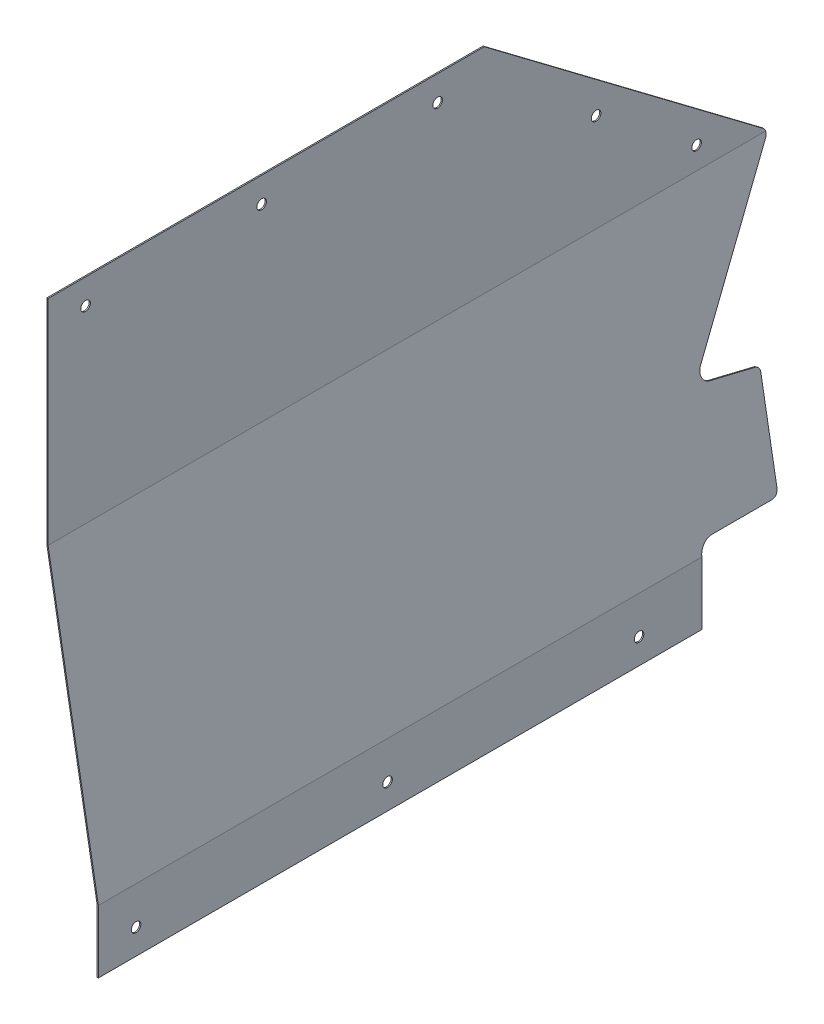
ISO-10303-21;
HEADER;
FILE_DESCRIPTION(('STEP AP214'),'2;1');
FILE_NAME('part.step','',(''),(''),'','','');
FILE_SCHEMA(('AUTOMOTIVE_DESIGN { 1 0 10303 214 1 1 1 1 }'));
ENDSEC;
DATA;
#1=APPLICATION_CONTEXT('core data for automotive mechanical design processes');
#2=APPLICATION_PROTOCOL_DEFINITION('international standard','automotive_design',2000,#1);
#3=PRODUCT_CONTEXT('',#1,'mechanical');
#4=PRODUCT('Part','Part','',(#3));
#5=PRODUCT_RELATED_PRODUCT_CATEGORY('part','',(#4));
#6=PRODUCT_DEFINITION_FORMATION('','',#4);
#7=PRODUCT_DEFINITION_CONTEXT('part definition',#1,'design');
#8=PRODUCT_DEFINITION('design','',#6,#7);
#9=PRODUCT_DEFINITION_SHAPE('','',#8);
#10=(LENGTH_UNIT() NAMED_UNIT(*) SI_UNIT(.MILLI.,.METRE.));
#11=(NAMED_UNIT(*) PLANE_ANGLE_UNIT() SI_UNIT($,.RADIAN.));
#12=(NAMED_UNIT(*) SI_UNIT($,.STERADIAN.) SOLID_ANGLE_UNIT());
#13=UNCERTAINTY_MEASURE_WITH_UNIT(LENGTH_MEASURE(1.E-05),#10,'distance_accuracy_value','');
#14=(GEOMETRIC_REPRESENTATION_CONTEXT(3) GLOBAL_UNCERTAINTY_ASSIGNED_CONTEXT((#13)) GLOBAL_UNIT_ASSIGNED_CONTEXT((#10,
#11,#12)) REPRESENTATION_CONTEXT('',''));
#15=CARTESIAN_POINT('',(0.,0.,0.));
#16=DIRECTION('',(0.,0.,1.));
#17=DIRECTION('',(1.,0.,0.));
#18=AXIS2_PLACEMENT_3D('',#15,#16,#17);
#19=CARTESIAN_POINT('',(266.7,5923.28000062489,-3055.84367308646));
#20=DIRECTION('',(0.,-0.798635510047341,0.601815023151985));
#21=DIRECTION('',(0.,0.601815023151985,0.798635510047341));
#22=AXIS2_PLACEMENT_3D('',#19,#20,#21);
#23=PLANE('',#22);
#24=DIRECTION('',(0.,0.601815023151988,0.798635510047338));
#25=VECTOR('',#24,1.);
#26=CARTESIAN_POINT('',(266.700000000003,5874.23441641765,-3120.92936163202));
#27=LINE('',#26,#25);
#28=CARTESIAN_POINT('',(266.700000000003,5874.23441641766,-3120.92936163202));
#29=VERTEX_POINT('',#28);
#30=CARTESIAN_POINT('',(266.699999999999,5980.43000062489,-2980.00306153083));
#31=VERTEX_POINT('',#30);
#32=EDGE_CURVE('E230',#29,#31,#27,.T.);
#33=ORIENTED_EDGE('',*,*,#32,.F.);
#34=DIRECTION('',(-0.995708210528336,-0.0556968651427743,-0.0739122364681644));
#35=VECTOR('',#34,1.);
#36=CARTESIAN_POINT('',(273.348331735291,5874.60630371574,-3120.43585051889));
#37=LINE('',#36,#35);
#38=CARTESIAN_POINT('',(266.090400000003,5874.20031726227,-3120.9746127396));
#39=VERTEX_POINT('',#38);
#40=EDGE_CURVE('E158',#29,#39,#37,.T.);
#41=ORIENTED_EDGE('',*,*,#40,.T.);
#42=DIRECTION('',(0.,0.601815023151969,0.798635510047353));
#43=VECTOR('',#42,1.);
#44=CARTESIAN_POINT('',(266.090400000003,5874.20031726228,-3120.97461273959));
#45=LINE('',#44,#43);
#46=CARTESIAN_POINT('',(266.090399999999,5980.43000062489,-2980.00306153083));
#47=VERTEX_POINT('',#46);
#48=EDGE_CURVE('E227',#39,#47,#45,.T.);
#49=ORIENTED_EDGE('',*,*,#48,.T.);
#50=DIRECTION('',(1.,0.,0.));
#51=VECTOR('',#50,1.);
#52=CARTESIAN_POINT('',(266.7,5980.43000062489,-2980.00306153083));
#53=LINE('',#52,#51);
#54=EDGE_CURVE('E239',#31,#47,#53,.F.);
#55=ORIENTED_EDGE('',*,*,#54,.F.);
#56=EDGE_LOOP('',(#33,#41,#49,#55));
#57=FACE_BOUND('',#56,.T.);
#58=ADVANCED_FACE('F39',(#57),#23,.F.);
#59=CARTESIAN_POINT('',(266.7,5980.43000062489,-2874.06989807406));
#60=DIRECTION('',(0.,-1.,0.));
#61=DIRECTION('',(1.,0.,0.));
#62=AXIS2_PLACEMENT_3D('',#59,#60,#61);
#63=PLANE('',#62);
#64=DIRECTION('',(1.,0.,0.));
#65=VECTOR('',#64,1.);
#66=CARTESIAN_POINT('',(266.7,5980.43000062489,-2759.71));
#67=LINE('',#66,#65);
#68=CARTESIAN_POINT('',(266.0904,5980.43000062489,-2759.71));
#69=VERTEX_POINT('',#68);
#70=CARTESIAN_POINT('',(266.7,5980.43000062489,-2759.71));
#71=VERTEX_POINT('',#70);
#72=EDGE_CURVE('E234',#69,#71,#67,.T.);
#73=ORIENTED_EDGE('',*,*,#72,.T.);
#74=DIRECTION('',(0.,0.,-1.));
#75=VECTOR('',#74,1.);
#76=CARTESIAN_POINT('',(266.7,5980.43000062489,-2759.71));
#77=LINE('',#76,#75);
#78=EDGE_CURVE('E233',#31,#71,#77,.F.);
#79=ORIENTED_EDGE('',*,*,#78,.F.);
#80=ORIENTED_EDGE('',*,*,#54,.T.);
#81=DIRECTION('',(0.,0.,-1.));
#82=VECTOR('',#81,1.);
#83=CARTESIAN_POINT('',(266.0904,5980.43000062489,-2759.71));
#84=LINE('',#83,#82);
#85=EDGE_CURVE('E223',#47,#69,#84,.F.);
#86=ORIENTED_EDGE('',*,*,#85,.T.);
#87=EDGE_LOOP('',(#73,#79,#80,#86));
#88=FACE_BOUND('',#87,.T.);
#89=ADVANCED_FACE('F292',(#88),#63,.F.);
#90=CARTESIAN_POINT('',(266.090400000003,5883.74292329504,-3087.20831702677));
#91=DIRECTION('',(1.,0.,0.));
#92=DIRECTION('',(0.,1.,0.));
#93=AXIS2_PLACEMENT_3D('',#90,#91,#92);
#94=CYLINDRICAL_SURFACE('',#93,2.41300000000024);
#95=CARTESIAN_POINT('',(266.090400000003,5883.74292329504,-3087.20831702677));
#96=DIRECTION('',(-1.,0.,0.));
#97=DIRECTION('',(0.,1.,0.));
#98=AXIS2_PLACEMENT_3D('',#95,#96,#97);
#99=CIRCLE('',#98,2.41300000000024);
#100=CARTESIAN_POINT('',(266.090400000003,5886.15592329504,-3087.20831702677));
#101=VERTEX_POINT('',#100);
#102=EDGE_CURVE('E226',#101,#101,#99,.T.);
#103=ORIENTED_EDGE('',*,*,#102,.T.);
#104=EDGE_LOOP('',(#103));
#105=FACE_BOUND('',#104,.T.);
#106=CARTESIAN_POINT('',(266.700000000003,5883.74292329504,-3087.20831702677));
#107=DIRECTION('',(-1.,0.,0.));
#108=DIRECTION('',(0.,1.,0.));
#109=AXIS2_PLACEMENT_3D('',#106,#107,#108);
#110=CIRCLE('',#109,2.41300000000024);
#111=CARTESIAN_POINT('',(266.700000000002,5886.15592329504,-3087.20831702677));
#112=VERTEX_POINT('',#111);
#113=EDGE_CURVE('E42',#112,#112,#110,.T.);
#114=ORIENTED_EDGE('',*,*,#113,.F.);
#115=EDGE_LOOP('',(#114));
#116=FACE_BOUND('',#115,.T.);
#117=ADVANCED_FACE('F297',(#105,#116),#94,.F.);
#118=CARTESIAN_POINT('',(266.090400000003,5921.95817726519,-3036.49496213877));
#119=DIRECTION('',(1.,0.,0.));
#120=DIRECTION('',(0.,1.,0.));
#121=AXIS2_PLACEMENT_3D('',#118,#119,#120);
#122=CYLINDRICAL_SURFACE('',#121,2.41300000000024);
#123=CARTESIAN_POINT('',(266.0904,5921.95817726519,-3036.49496213877));
#124=DIRECTION('',(-1.,0.,0.));
#125=DIRECTION('',(0.,1.,0.));
#126=AXIS2_PLACEMENT_3D('',#123,#124,#125);
#127=CIRCLE('',#126,2.41300000000024);
#128=CARTESIAN_POINT('',(266.0904,5924.37117726519,-3036.49496213877));
#129=VERTEX_POINT('',#128);
#130=EDGE_CURVE('E479',#129,#129,#127,.T.);
#131=ORIENTED_EDGE('',*,*,#130,.T.);
#132=EDGE_LOOP('',(#131));
#133=FACE_BOUND('',#132,.T.);
#134=CARTESIAN_POINT('',(266.700000000003,5921.95817726519,-3036.49496213877));
#135=DIRECTION('',(-1.,0.,0.));
#136=DIRECTION('',(0.,1.,0.));
#137=AXIS2_PLACEMENT_3D('',#134,#135,#136);
#138=CIRCLE('',#137,2.41300000000024);
#139=CARTESIAN_POINT('',(266.700000000002,5924.37117726519,-3036.49496213877));
#140=VERTEX_POINT('',#139);
#141=EDGE_CURVE('E385',#140,#140,#138,.T.);
#142=ORIENTED_EDGE('',*,*,#141,.F.);
#143=EDGE_LOOP('',(#142));
#144=FACE_BOUND('',#143,.T.);
#145=ADVANCED_FACE('F394',(#133,#144),#122,.F.);
#146=CARTESIAN_POINT('',(266.0904,5967.73000051653,-2956.44607591665));
#147=DIRECTION('',(1.,0.,0.));
#148=DIRECTION('',(0.,1.,0.));
#149=AXIS2_PLACEMENT_3D('',#146,#147,#148);
#150=CYLINDRICAL_SURFACE('',#149,2.41300000000024);
#151=CARTESIAN_POINT('',(266.0904,5967.73000051653,-2956.44607591665));
#152=DIRECTION('',(-1.,0.,0.));
#153=DIRECTION('',(0.,1.,0.));
#154=AXIS2_PLACEMENT_3D('',#151,#152,#153);
#155=CIRCLE('',#154,2.41300000000024);
#156=CARTESIAN_POINT('',(266.0904,5970.14300051653,-2956.44607591665));
#157=VERTEX_POINT('',#156);
#158=EDGE_CURVE('E477',#157,#157,#155,.T.);
#159=ORIENTED_EDGE('',*,*,#158,.T.);
#160=EDGE_LOOP('',(#159));
#161=FACE_BOUND('',#160,.T.);
#162=CARTESIAN_POINT('',(266.7,5967.73000051653,-2956.44607591665));
#163=DIRECTION('',(-1.,0.,0.));
#164=DIRECTION('',(0.,1.,0.));
#165=AXIS2_PLACEMENT_3D('',#162,#163,#164);
#166=CIRCLE('',#165,2.41300000000024);
#167=CARTESIAN_POINT('',(266.7,5970.14300051653,-2956.44607591665));
#168=VERTEX_POINT('',#167);
#169=EDGE_CURVE('E216',#168,#168,#166,.T.);
#170=ORIENTED_EDGE('',*,*,#169,.F.);
#171=EDGE_LOOP('',(#170));
#172=FACE_BOUND('',#171,.T.);
#173=ADVANCED_FACE('F400',(#161,#172),#150,.F.);
#174=CARTESIAN_POINT('',(266.0904,5967.73000018003,-2778.64607591665));
#175=DIRECTION('',(1.,0.,0.));
#176=DIRECTION('',(0.,1.,0.));
#177=AXIS2_PLACEMENT_3D('',#174,#175,#176);
#178=CYLINDRICAL_SURFACE('',#177,2.41300000000024);
#179=CARTESIAN_POINT('',(266.0904,5967.73000018003,-2778.64607591665));
#180=DIRECTION('',(-1.,0.,0.));
#181=DIRECTION('',(0.,1.,0.));
#182=AXIS2_PLACEMENT_3D('',#179,#180,#181);
#183=CIRCLE('',#182,2.41300000000024);
#184=CARTESIAN_POINT('',(266.0904,5970.14300018004,-2778.64607591665));
#185=VERTEX_POINT('',#184);
#186=EDGE_CURVE('E474',#185,#185,#183,.T.);
#187=ORIENTED_EDGE('',*,*,#186,.T.);
#188=EDGE_LOOP('',(#187));
#189=FACE_BOUND('',#188,.T.);
#190=CARTESIAN_POINT('',(266.7,5967.73000018003,-2778.64607591665));
#191=DIRECTION('',(-1.,0.,0.));
#192=DIRECTION('',(0.,1.,0.));
#193=AXIS2_PLACEMENT_3D('',#190,#191,#192);
#194=CIRCLE('',#193,2.41300000000024);
#195=CARTESIAN_POINT('',(266.7,5970.14300018004,-2778.64607591665));
#196=VERTEX_POINT('',#195);
#197=EDGE_CURVE('E380',#196,#196,#194,.T.);
#198=ORIENTED_EDGE('',*,*,#197,.F.);
#199=EDGE_LOOP('',(#198));
#200=FACE_BOUND('',#199,.T.);
#201=ADVANCED_FACE('F407',(#189,#200),#178,.F.);
#202=CARTESIAN_POINT('',(266.0904,5967.73000034828,-2867.54607591665));
#203=DIRECTION('',(1.,0.,0.));
#204=DIRECTION('',(0.,1.,0.));
#205=AXIS2_PLACEMENT_3D('',#202,#203,#204);
#206=CYLINDRICAL_SURFACE('',#205,2.41300000000024);
#207=CARTESIAN_POINT('',(266.0904,5967.73000034828,-2867.54607591665));
#208=DIRECTION('',(-1.,0.,0.));
#209=DIRECTION('',(0.,1.,0.));
#210=AXIS2_PLACEMENT_3D('',#207,#208,#209);
#211=CIRCLE('',#210,2.41300000000024);
#212=CARTESIAN_POINT('',(266.0904,5970.14300034829,-2867.54607591665));
#213=VERTEX_POINT('',#212);
#214=EDGE_CURVE('E250',#213,#213,#211,.T.);
#215=ORIENTED_EDGE('',*,*,#214,.T.);
#216=EDGE_LOOP('',(#215));
#217=FACE_BOUND('',#216,.T.);
#218=CARTESIAN_POINT('',(266.7,5967.73000034828,-2867.54607591665));
#219=DIRECTION('',(-1.,0.,0.));
#220=DIRECTION('',(0.,1.,0.));
#221=AXIS2_PLACEMENT_3D('',#218,#219,#220);
#222=CIRCLE('',#221,2.41300000000024);
#223=CARTESIAN_POINT('',(266.7,5970.14300034829,-2867.54607591665));
#224=VERTEX_POINT('',#223);
#225=EDGE_CURVE('E383',#224,#224,#222,.T.);
#226=ORIENTED_EDGE('',*,*,#225,.F.);
#227=EDGE_LOOP('',(#226));
#228=FACE_BOUND('',#227,.T.);
#229=ADVANCED_FACE('F411',(#217,#228),#206,.F.);
#230=CARTESIAN_POINT('',(266.7,5974.08000062489,-2759.71));
#231=DIRECTION('',(-1.,0.,0.));
#232=DIRECTION('',(0.,-1.,0.));
#233=AXIS2_PLACEMENT_3D('',#230,#231,#232);
#234=PLANE('',#233);
#235=ORIENTED_EDGE('',*,*,#169,.T.);
#236=EDGE_LOOP('',(#235));
#237=FACE_BOUND('',#236,.T.);
#238=ORIENTED_EDGE('',*,*,#197,.T.);
#239=EDGE_LOOP('',(#238));
#240=FACE_BOUND('',#239,.T.);
#241=ORIENTED_EDGE('',*,*,#225,.T.);
#242=EDGE_LOOP('',(#241));
#243=FACE_BOUND('',#242,.T.);
#244=ORIENTED_EDGE('',*,*,#141,.T.);
#245=EDGE_LOOP('',(#244));
#246=FACE_BOUND('',#245,.T.);
#247=ORIENTED_EDGE('',*,*,#113,.T.);
#248=EDGE_LOOP('',(#247));
#249=FACE_BOUND('',#248,.T.);
#250=DIRECTION('',(0.,0.,-1.));
#251=VECTOR('',#250,1.);
#252=CARTESIAN_POINT('',(266.7,5872.48000062489,-2759.71));
#253=LINE('',#252,#251);
#254=CARTESIAN_POINT('',(266.700000000001,5872.48000062488,-3122.10149619294));
#255=VERTEX_POINT('',#254);
#256=CARTESIAN_POINT('',(266.7,5872.48000062489,-2759.71));
#257=VERTEX_POINT('',#256);
#258=EDGE_CURVE('E162',#255,#257,#253,.F.);
#259=ORIENTED_EDGE('',*,*,#258,.F.);
#260=CARTESIAN_POINT('',(266.700000000003,5871.69874867326,-3119.01859893352));
#261=DIRECTION('',(1.,0.,0.));
#262=DIRECTION('',(0.,-0.601815023151986,-0.79863551004734));
#263=AXIS2_PLACEMENT_3D('',#260,#261,#262);
#264=ELLIPSE('',#263,3.1886851654214,3.175);
#265=EDGE_CURVE('E141',#255,#29,#264,.T.);
#266=ORIENTED_EDGE('',*,*,#265,.T.);
#267=ORIENTED_EDGE('',*,*,#32,.T.);
#268=ORIENTED_EDGE('',*,*,#78,.T.);
#269=DIRECTION('',(0.,1.,0.));
#270=VECTOR('',#269,1.);
#271=CARTESIAN_POINT('',(266.7,5715.,-2759.71));
#272=LINE('',#271,#270);
#273=EDGE_CURVE('E249',#257,#71,#272,.T.);
#274=ORIENTED_EDGE('',*,*,#273,.F.);
#275=EDGE_LOOP('',(#259,#266,#267,#268,#274));
#276=FACE_BOUND('',#275,.T.);
#277=ADVANCED_FACE('F304',(#237,#240,#243,#246,#249,#276),#234,.F.);
#278=CARTESIAN_POINT('',(292.1,5727.7,-2759.71));
#279=DIRECTION('',(-1.,0.,0.));
#280=DIRECTION('',(0.,0.,-1.));
#281=AXIS2_PLACEMENT_3D('',#278,#279,#280);
#282=PLANE('',#281);
#283=CARTESIAN_POINT('',(292.1,5708.65,-2778.76));
#284=DIRECTION('',(-1.,0.,0.));
#285=DIRECTION('',(0.,0.,1.));
#286=AXIS2_PLACEMENT_3D('',#283,#284,#285);
#287=CIRCLE('',#286,2.4129999999991);
#288=CARTESIAN_POINT('',(292.1,5708.65,-2776.347));
#289=VERTEX_POINT('',#288);
#290=EDGE_CURVE('E166',#289,#289,#287,.F.);
#291=ORIENTED_EDGE('',*,*,#290,.F.);
#292=EDGE_LOOP('',(#291));
#293=FACE_BOUND('',#292,.T.);
#294=CARTESIAN_POINT('',(292.1,5708.65,-2905.76));
#295=DIRECTION('',(-1.,0.,0.));
#296=DIRECTION('',(0.,0.,1.));
#297=AXIS2_PLACEMENT_3D('',#294,#295,#296);
#298=CIRCLE('',#297,2.4129999999991);
#299=CARTESIAN_POINT('',(292.1,5708.65,-2903.347));
#300=VERTEX_POINT('',#299);
#301=EDGE_CURVE('E373',#300,#300,#298,.F.);
#302=ORIENTED_EDGE('',*,*,#301,.F.);
#303=EDGE_LOOP('',(#302));
#304=FACE_BOUND('',#303,.T.);
#305=CARTESIAN_POINT('',(292.1,5708.65,-3032.76));
#306=DIRECTION('',(-1.,0.,0.));
#307=DIRECTION('',(0.,0.,1.));
#308=AXIS2_PLACEMENT_3D('',#305,#306,#307);
#309=CIRCLE('',#308,2.4129999999991);
#310=CARTESIAN_POINT('',(292.1,5708.65,-3030.347));
#311=VERTEX_POINT('',#310);
#312=EDGE_CURVE('E194',#311,#311,#309,.F.);
#313=ORIENTED_EDGE('',*,*,#312,.F.);
#314=EDGE_LOOP('',(#313));
#315=FACE_BOUND('',#314,.T.);
#316=DIRECTION('',(0.,0.,-1.));
#317=VECTOR('',#316,1.);
#318=CARTESIAN_POINT('',(292.1,5695.95,-2912.11));
#319=LINE('',#318,#317);
#320=CARTESIAN_POINT('',(292.1,5695.95,-3064.51));
#321=VERTEX_POINT('',#320);
#322=CARTESIAN_POINT('',(292.1,5695.95,-2759.71));
#323=VERTEX_POINT('',#322);
#324=EDGE_CURVE('E213',#321,#323,#319,.F.);
#325=ORIENTED_EDGE('',*,*,#324,.F.);
#326=DIRECTION('',(0.,1.,0.));
#327=VECTOR('',#326,1.);
#328=CARTESIAN_POINT('',(292.1,5715.,-3064.51));
#329=LINE('',#328,#327);
#330=CARTESIAN_POINT('',(292.1,5727.7,-3064.51));
#331=VERTEX_POINT('',#330);
#332=EDGE_CURVE('E198',#331,#321,#329,.F.);
#333=ORIENTED_EDGE('',*,*,#332,.F.);
#334=DIRECTION('',(0.,0.,-1.));
#335=VECTOR('',#334,1.);
#336=CARTESIAN_POINT('',(292.100000000001,5727.7,-2759.71));
#337=LINE('',#336,#335);
#338=CARTESIAN_POINT('',(292.1,5727.7,-2759.71));
#339=VERTEX_POINT('',#338);
#340=EDGE_CURVE('E145',#339,#331,#337,.T.);
#341=ORIENTED_EDGE('',*,*,#340,.F.);
#342=DIRECTION('',(0.,1.,0.));
#343=VECTOR('',#342,1.);
#344=CARTESIAN_POINT('',(292.1,5715.,-2759.71));
#345=LINE('',#344,#343);
#346=EDGE_CURVE('E209',#323,#339,#345,.T.);
#347=ORIENTED_EDGE('',*,*,#346,.F.);
#348=EDGE_LOOP('',(#325,#333,#341,#347));
#349=FACE_BOUND('',#348,.T.);
#350=ADVANCED_FACE('F418',(#293,#304,#315,#349),#282,.F.);
#351=CARTESIAN_POINT('',(292.1,5695.95,-2912.11));
#352=DIRECTION('',(0.,1.,0.));
#353=DIRECTION('',(-1.,0.,0.));
#354=AXIS2_PLACEMENT_3D('',#351,#352,#353);
#355=PLANE('',#354);
#356=DIRECTION('',(-1.,0.,0.));
#357=VECTOR('',#356,1.);
#358=CARTESIAN_POINT('',(292.1,5695.95,-3064.51));
#359=LINE('',#358,#357);
#360=CARTESIAN_POINT('',(291.490399999999,5695.95,-3064.51));
#361=VERTEX_POINT('',#360);
#362=EDGE_CURVE('E195',#321,#361,#359,.T.);
#363=ORIENTED_EDGE('',*,*,#362,.F.);
#364=ORIENTED_EDGE('',*,*,#324,.T.);
#365=DIRECTION('',(1.,0.,0.));
#366=VECTOR('',#365,1.);
#367=CARTESIAN_POINT('',(292.1,5695.95,-2759.71));
#368=LINE('',#367,#366);
#369=CARTESIAN_POINT('',(291.4904,5695.95,-2759.71));
#370=VERTEX_POINT('',#369);
#371=EDGE_CURVE('E206',#370,#323,#368,.T.);
#372=ORIENTED_EDGE('',*,*,#371,.F.);
#373=DIRECTION('',(0.,0.,-1.));
#374=VECTOR('',#373,1.);
#375=CARTESIAN_POINT('',(291.4904,5695.95,-2759.71));
#376=LINE('',#375,#374);
#377=EDGE_CURVE('E188',#370,#361,#376,.T.);
#378=ORIENTED_EDGE('',*,*,#377,.T.);
#379=EDGE_LOOP('',(#363,#364,#372,#378));
#380=FACE_BOUND('',#379,.T.);
#381=ADVANCED_FACE('F422',(#380),#355,.F.);
#382=CARTESIAN_POINT('',(292.1,5715.,-3064.51));
#383=DIRECTION('',(0.,0.,1.));
#384=DIRECTION('',(-1.,0.,0.));
#385=AXIS2_PLACEMENT_3D('',#382,#383,#384);
#386=PLANE('',#385);
#387=DIRECTION('',(0.,1.,0.));
#388=VECTOR('',#387,1.);
#389=CARTESIAN_POINT('',(291.490399999999,5727.7,-3064.51));
#390=LINE('',#389,#388);
#391=CARTESIAN_POINT('',(291.490399999999,5727.59305263203,-3064.51));
#392=VERTEX_POINT('',#391);
#393=EDGE_CURVE('E184',#361,#392,#390,.T.);
#394=ORIENTED_EDGE('',*,*,#393,.T.);
#395=DIRECTION('',(0.984957024770471,0.172799477300427,0.));
#396=VECTOR('',#395,1.);
#397=CARTESIAN_POINT('',(291.4904,5727.59305263203,-3064.51));
#398=LINE('',#397,#396);
#399=EDGE_CURVE('E191',#392,#331,#398,.T.);
#400=ORIENTED_EDGE('',*,*,#399,.T.);
#401=ORIENTED_EDGE('',*,*,#332,.T.);
#402=ORIENTED_EDGE('',*,*,#362,.T.);
#403=EDGE_LOOP('',(#394,#400,#401,#402));
#404=FACE_BOUND('',#403,.T.);
#405=ADVANCED_FACE('F426',(#404),#386,.F.);
#406=CARTESIAN_POINT('',(291.4904,5708.65,-3032.76));
#407=DIRECTION('',(1.,0.,0.));
#408=DIRECTION('',(0.,0.,1.));
#409=AXIS2_PLACEMENT_3D('',#406,#407,#408);
#410=CYLINDRICAL_SURFACE('',#409,2.4129999999991);
#411=CARTESIAN_POINT('',(291.4904,5708.65,-3032.76));
#412=DIRECTION('',(-1.,0.,0.));
#413=DIRECTION('',(0.,0.,1.));
#414=AXIS2_PLACEMENT_3D('',#411,#412,#413);
#415=CIRCLE('',#414,2.4129999999991);
#416=CARTESIAN_POINT('',(291.4904,5708.65,-3030.347));
#417=VERTEX_POINT('',#416);
#418=EDGE_CURVE('E187',#417,#417,#415,.T.);
#419=ORIENTED_EDGE('',*,*,#418,.T.);
#420=EDGE_LOOP('',(#419));
#421=FACE_BOUND('',#420,.T.);
#422=ORIENTED_EDGE('',*,*,#312,.T.);
#423=EDGE_LOOP('',(#422));
#424=FACE_BOUND('',#423,.T.);
#425=ADVANCED_FACE('F430',(#421,#424),#410,.F.);
#426=CARTESIAN_POINT('',(291.4904,5708.65,-2905.76));
#427=DIRECTION('',(1.,0.,0.));
#428=DIRECTION('',(0.,0.,1.));
#429=AXIS2_PLACEMENT_3D('',#426,#427,#428);
#430=CYLINDRICAL_SURFACE('',#429,2.4129999999991);
#431=CARTESIAN_POINT('',(291.4904,5708.65,-2905.76));
#432=DIRECTION('',(-1.,0.,0.));
#433=DIRECTION('',(0.,0.,1.));
#434=AXIS2_PLACEMENT_3D('',#431,#432,#433);
#435=CIRCLE('',#434,2.4129999999991);
#436=CARTESIAN_POINT('',(291.4904,5708.65,-2903.347));
#437=VERTEX_POINT('',#436);
#438=EDGE_CURVE('E467',#437,#437,#435,.T.);
#439=ORIENTED_EDGE('',*,*,#438,.T.);
#440=EDGE_LOOP('',(#439));
#441=FACE_BOUND('',#440,.T.);
#442=ORIENTED_EDGE('',*,*,#301,.T.);
#443=EDGE_LOOP('',(#442));
#444=FACE_BOUND('',#443,.T.);
#445=ADVANCED_FACE('F434',(#441,#444),#430,.F.);
#446=CARTESIAN_POINT('',(291.4904,5708.65,-2778.76));
#447=DIRECTION('',(1.,0.,0.));
#448=DIRECTION('',(0.,0.,1.));
#449=AXIS2_PLACEMENT_3D('',#446,#447,#448);
#450=CYLINDRICAL_SURFACE('',#449,2.4129999999991);
#451=CARTESIAN_POINT('',(291.4904,5708.65,-2778.76));
#452=DIRECTION('',(-1.,0.,0.));
#453=DIRECTION('',(0.,0.,1.));
#454=AXIS2_PLACEMENT_3D('',#451,#452,#453);
#455=CIRCLE('',#454,2.4129999999991);
#456=CARTESIAN_POINT('',(291.4904,5708.65,-2776.347));
#457=VERTEX_POINT('',#456);
#458=EDGE_CURVE('E464',#457,#457,#455,.T.);
#459=ORIENTED_EDGE('',*,*,#458,.T.);
#460=EDGE_LOOP('',(#459));
#461=FACE_BOUND('',#460,.T.);
#462=ORIENTED_EDGE('',*,*,#290,.T.);
#463=EDGE_LOOP('',(#462));
#464=FACE_BOUND('',#463,.T.);
#465=ADVANCED_FACE('F438',(#461,#464),#450,.F.);
#466=CARTESIAN_POINT('',(266.7,5872.48000062489,-2759.71));
#467=DIRECTION('',(-0.984957024773253,-0.172799477284575,0.));
#468=DIRECTION('',(0.172799477284575,-0.984957024773253,0.));
#469=AXIS2_PLACEMENT_3D('',#466,#467,#468);
#470=PLANE('',#469);
#471=DIRECTION('',(0.146160865656875,-0.833116937839947,0.533435253085717));
#472=VECTOR('',#471,1.);
#473=CARTESIAN_POINT('',(267.128392793614,5870.03816169075,-3121.69406846455));
#474=LINE('',#473,#472);
#475=CARTESIAN_POINT('',(267.128392793614,5870.03816169075,-3121.69406846455));
#476=VERTEX_POINT('',#475);
#477=CARTESIAN_POINT('',(279.530224284907,5799.34772188527,-3076.43178782224));
#478=VERTEX_POINT('',#477);
#479=EDGE_CURVE('E130',#476,#478,#474,.T.);
#480=ORIENTED_EDGE('',*,*,#479,.F.);
#481=CARTESIAN_POINT('',(266.835729761662,5871.70634098007,-3119.00852360208));
#482=DIRECTION('',(0.984957024773253,0.172799477284575,0.));
#483=DIRECTION('',(-0.146160865656866,0.833116937839948,-0.533435253085718));
#484=AXIS2_PLACEMENT_3D('',#481,#482,#483);
#485=ELLIPSE('',#484,3.20592374488722,3.175);
#486=EDGE_CURVE('E138',#476,#255,#485,.T.);
#487=ORIENTED_EDGE('',*,*,#486,.T.);
#488=ORIENTED_EDGE('',*,*,#258,.T.);
#489=DIRECTION('',(-0.172799477284568,0.984957024773254,0.));
#490=VECTOR('',#489,1.);
#491=CARTESIAN_POINT('',(292.1,5727.7,-2759.71));
#492=LINE('',#491,#490);
#493=EDGE_CURVE('E246',#339,#257,#492,.T.);
#494=ORIENTED_EDGE('',*,*,#493,.F.);
#495=ORIENTED_EDGE('',*,*,#340,.T.);
#496=CARTESIAN_POINT('',(292.100000000002,5727.69999999999,-3070.86));
#497=DIRECTION('',(0.984957024773253,0.172799477284575,0.));
#498=DIRECTION('',(0.172799477284575,-0.984957024773253,0.));
#499=AXIS2_PLACEMENT_3D('',#496,#497,#498);
#500=CIRCLE('',#499,6.35000000000041);
#501=CARTESIAN_POINT('',(291.002723319244,5733.9544771073,-3070.86));
#502=VERTEX_POINT('',#501);
#503=EDGE_CURVE('E462',#502,#331,#500,.T.);
#504=ORIENTED_EDGE('',*,*,#503,.F.);
#505=DIRECTION('',(0.,0.,-1.));
#506=VECTOR('',#505,1.);
#507=CARTESIAN_POINT('',(291.002723319244,5733.9544771073,-3084.31254276006));
#508=LINE('',#507,#506);
#509=CARTESIAN_POINT('',(291.002723319243,5733.95447710731,-3100.94008552015));
#510=VERTEX_POINT('',#509);
#511=EDGE_CURVE('E179',#510,#502,#508,.F.);
#512=ORIENTED_EDGE('',*,*,#511,.F.);
#513=CARTESIAN_POINT('',(290.454084978864,5737.08171566097,-3100.94008552015));
#514=DIRECTION('',(0.984957024773253,0.172799477284575,0.));
#515=DIRECTION('',(0.172799477284575,-0.984957024773253,0.));
#516=AXIS2_PLACEMENT_3D('',#513,#514,#515);
#517=CIRCLE('',#516,3.175);
#518=CARTESIAN_POINT('',(290.454084978864,5737.08171566097,-3104.11508552015));
#519=VERTEX_POINT('',#518);
#520=EDGE_CURVE('E178',#510,#519,#517,.T.);
#521=ORIENTED_EDGE('',*,*,#520,.T.);
#522=DIRECTION('',(0.1727994772846,-0.984957024773248,0.));
#523=VECTOR('',#522,1.);
#524=CARTESIAN_POINT('',(282.251141713603,5783.83849247476,-3104.11508552015));
#525=LINE('',#524,#523);
#526=CARTESIAN_POINT('',(282.251141713603,5783.83849247476,-3104.11508552015));
#527=VERTEX_POINT('',#526);
#528=EDGE_CURVE('E174',#527,#519,#525,.T.);
#529=ORIENTED_EDGE('',*,*,#528,.F.);
#530=CARTESIAN_POINT('',(282.251141713603,5783.83849247476,-3100.94008552015));
#531=DIRECTION('',(0.984957024773253,0.172799477284575,0.));
#532=DIRECTION('',(0.172799477284575,-0.984957024773253,0.));
#533=AXIS2_PLACEMENT_3D('',#530,#531,#532);
#534=CIRCLE('',#533,3.175);
#535=CARTESIAN_POINT('',(281.715074103886,5786.89407786333,-3101.61584764618));
#536=VERTEX_POINT('',#535);
#537=EDGE_CURVE('E173',#527,#536,#534,.T.);
#538=ORIENTED_EDGE('',*,*,#537,.T.);
#539=DIRECTION('',(0.0367783754794001,-0.20963674113813,-0.977087400318969));
#540=VECTOR('',#539,1.);
#541=CARTESIAN_POINT('',(280.888621346357,5791.6048586016,-3079.65956040361));
#542=LINE('',#541,#540);
#543=CARTESIAN_POINT('',(280.888621346355,5791.60485860161,-3079.65956040361));
#544=VERTEX_POINT('',#543);
#545=EDGE_CURVE('E169',#544,#536,#542,.T.);
#546=ORIENTED_EDGE('',*,*,#545,.F.);
#547=CARTESIAN_POINT('',(280.888621346353,5791.60485860161,-3079.65956040361));
#548=CARTESIAN_POINT('',(280.884848342892,5791.62636472143,-3079.55932948785));
#549=CARTESIAN_POINT('',(280.880547676344,5791.65087852086,-3079.45979649507));
#550=CARTESIAN_POINT('',(280.870905994527,5791.70583610745,-3079.26242308206));
#551=CARTESIAN_POINT('',(280.865564887597,5791.73628041709,-3079.16458281178));
#552=CARTESIAN_POINT('',(280.847999139526,5791.83640518152,-3078.87398367353));
#553=CARTESIAN_POINT('',(280.834235564544,5791.91485755926,-3078.68423910635));
#554=CARTESIAN_POINT('',(280.807596877792,5792.0666980744,-3078.37163147867));
#555=CARTESIAN_POINT('',(280.795710638991,5792.13444963586,-3078.24588785874));
#556=CARTESIAN_POINT('',(280.770143939367,5792.28017982434,-3078.00060474061));
#557=CARTESIAN_POINT('',(280.756463156173,5792.35816028888,-3077.88106636252));
#558=CARTESIAN_POINT('',(280.727408992208,5792.5237690242,-3077.649035355));
#559=CARTESIAN_POINT('',(280.712035019595,5792.61140066848,-3077.53654521092));
#560=CARTESIAN_POINT('',(280.679712440808,5792.79563936835,-3077.31941344795));
#561=CARTESIAN_POINT('',(280.66276382592,5792.89224647363,-3077.21477187252));
#562=CARTESIAN_POINT('',(280.627391230603,5793.0938702678,-3077.01389772218));
#563=CARTESIAN_POINT('',(280.60896516576,5793.19889883787,-3076.9176774429));
#564=CARTESIAN_POINT('',(280.570799183101,5793.41644493997,-3076.73448274289));
#565=CARTESIAN_POINT('',(280.551059716736,5793.52895989873,-3076.64750517162));
#566=CARTESIAN_POINT('',(280.510393854882,5793.7607553123,-3076.48329050422));
#567=CARTESIAN_POINT('',(280.489466966219,5793.8800385782,-3076.40605749889));
#568=CARTESIAN_POINT('',(280.446589036532,5794.12444277846,-3076.26189607133));
#569=CARTESIAN_POINT('',(280.424638355268,5794.24956166219,-3076.19496406437));
#570=CARTESIAN_POINT('',(280.379517826569,5794.50674867689,-3076.07085838795));
#571=CARTESIAN_POINT('',(280.356334513824,5794.63889356011,-3076.01384862612));
#572=CARTESIAN_POINT('',(280.309235311803,5794.9073590128,-3075.9112386317));
#573=CARTESIAN_POINT('',(280.285319680024,5795.04367811453,-3075.86563443926));
#574=CARTESIAN_POINT('',(280.236908913823,5795.31961948306,-3075.78608874138));
#575=CARTESIAN_POINT('',(280.212413618454,5795.45924266727,-3075.75215051667));
#576=CARTESIAN_POINT('',(280.163029459495,5795.74073237455,-3075.69617909299));
#577=CARTESIAN_POINT('',(280.138140739312,5795.88259808021,-3075.67414165459));
#578=CARTESIAN_POINT('',(280.08783079758,5796.16936474932,-3075.64189794076));
#579=CARTESIAN_POINT('',(280.062406775534,5796.3142816756,-3075.63183783692));
#580=CARTESIAN_POINT('',(280.011511760691,5796.60438326146,-3075.62410105523));
#581=CARTESIAN_POINT('',(279.986040788003,5796.74956780641,-3075.62641993868));
#582=CARTESIAN_POINT('',(279.935209200436,5797.03930785679,-3075.64342026906));
#583=CARTESIAN_POINT('',(279.909848648681,5797.18386300242,-3075.65810804001));
#584=CARTESIAN_POINT('',(279.859439736828,5797.47119380122,-3075.69975245984));
#585=CARTESIAN_POINT('',(279.834391263429,5797.61397010022,-3075.72670451438));
#586=CARTESIAN_POINT('',(279.784906040354,5797.89603587296,-3075.79252785405));
#587=CARTESIAN_POINT('',(279.760466754175,5798.03533980478,-3075.83133528138));
#588=CARTESIAN_POINT('',(279.712236134426,5798.31025433853,-3075.92066591643));
#589=CARTESIAN_POINT('',(279.688444796215,5798.44586496692,-3075.9711890402));
#590=CARTESIAN_POINT('',(279.641661452209,5798.71253002891,-3076.08367256004));
#591=CARTESIAN_POINT('',(279.618670089486,5798.84358079699,-3076.14564191594));
#592=CARTESIAN_POINT('',(279.573669000324,5799.10008700633,-3076.28057501204));
#593=CARTESIAN_POINT('',(279.551659373479,5799.22554187989,-3076.35353986444));
#594=CARTESIAN_POINT('',(279.530224284909,5799.34772188527,-3076.43178782224));
#595=B_SPLINE_CURVE_WITH_KNOTS('',3,(#547,#548,#549,#550,#551,#552,#553,#554,#555,#556,#557,
#558,#559,#560,#561,#562,#563,#564,#565,#566,#567,#568,#569,#570,#571,#572,#573,#574,#575,#576,
#577,#578,#579,#580,#581,#582,#583,#584,#585,#586,#587,#588,#589,#590,#591,#592,#593,#594),
.UNSPECIFIED.,.F.,.F.,(4,2,2,2,2,2,2,2,2,2,2,2,2,2,2,2,2,2,2,2,2,2,2,4),(0.,0.307633417334413,
0.615293949232706,1.23089758657611,1.66043181687526,2.09004331422486,2.51980545848829,
2.94956998152197,3.37995186911374,3.8101865797786,4.2406013073125,4.67086591037817,
5.10767480087287,5.54433182618215,5.98111154900773,6.41773557492036,6.85963526576051,
7.30137651641049,7.74334375981077,8.18514557345013,8.6246084151681,9.06406810822765,
9.50387326879986,9.94372294549397),.UNSPECIFIED.);
#596=EDGE_CURVE('E151',#544,#478,#595,.T.);
#597=ORIENTED_EDGE('',*,*,#596,.T.);
#598=EDGE_LOOP('',(#480,#487,#488,#494,#495,#504,#512,#521,#529,#538,#546,#597));
#599=FACE_BOUND('',#598,.T.);
#600=ADVANCED_FACE('F148',(#599),#470,.F.);
#601=CARTESIAN_POINT('',(273.348331735291,5872.07063597133,-3118.52508782038));
#602=DIRECTION('',(-0.995708210528336,-0.0556968651427743,-0.0739122364681644));
#603=DIRECTION('',(0.0740271469704956,0.,-0.997256226609495));
#604=AXIS2_PLACEMENT_3D('',#601,#602,#603);
#605=CYLINDRICAL_SURFACE('',#604,3.175);
#606=ORIENTED_EDGE('',*,*,#40,.F.);
#607=ORIENTED_EDGE('',*,*,#265,.F.);
#608=ORIENTED_EDGE('',*,*,#486,.F.);
#609=DIRECTION('',(0.995708210528278,0.0556968651464875,0.0739122364661521));
#610=VECTOR('',#609,1.);
#611=CARTESIAN_POINT('',(266.515497191352,5870.00387818947,-3121.73956420738));
#612=LINE('',#611,#610);
#613=CARTESIAN_POINT('',(266.515497191354,5870.00387818947,-3121.73956420739));
#614=VERTEX_POINT('',#613);
#615=EDGE_CURVE('E126',#614,#476,#612,.T.);
#616=ORIENTED_EDGE('',*,*,#615,.F.);
#617=CARTESIAN_POINT('',(266.222834159401,5871.6720574788,-3119.05401934491));
#618=DIRECTION('',(0.984957024773253,0.172799477284575,0.));
#619=DIRECTION('',(-0.146160865656866,0.833116937839948,-0.533435253085718));
#620=AXIS2_PLACEMENT_3D('',#617,#618,#619);
#621=ELLIPSE('',#620,3.20592374488722,3.175);
#622=CARTESIAN_POINT('',(266.090400000004,5872.42693219062,-3122.1515771035));
#623=VERTEX_POINT('',#622);
#624=EDGE_CURVE('E133',#614,#623,#621,.T.);
#625=ORIENTED_EDGE('',*,*,#624,.T.);
#626=CARTESIAN_POINT('',(266.090400000003,5871.66464951787,-3119.0638500411));
#627=DIRECTION('',(1.,0.,0.));
#628=DIRECTION('',(0.,-0.601815023151986,-0.79863551004734));
#629=AXIS2_PLACEMENT_3D('',#626,#627,#628);
#630=ELLIPSE('',#629,3.1886851654214,3.175);
#631=EDGE_CURVE('E362',#623,#39,#630,.T.);
#632=ORIENTED_EDGE('',*,*,#631,.T.);
#633=EDGE_LOOP('',(#606,#607,#608,#616,#625,#632));
#634=FACE_BOUND('',#633,.T.);
#635=ADVANCED_FACE('F140',(#634),#605,.T.);
#636=CARTESIAN_POINT('',(266.0904,5974.08000062489,-2759.71));
#637=DIRECTION('',(-1.,0.,0.));
#638=DIRECTION('',(0.,-1.,0.));
#639=AXIS2_PLACEMENT_3D('',#636,#637,#638);
#640=PLANE('',#639);
#641=ORIENTED_EDGE('',*,*,#214,.F.);
#642=EDGE_LOOP('',(#641));
#643=FACE_BOUND('',#642,.T.);
#644=ORIENTED_EDGE('',*,*,#186,.F.);
#645=EDGE_LOOP('',(#644));
#646=FACE_BOUND('',#645,.T.);
#647=ORIENTED_EDGE('',*,*,#158,.F.);
#648=EDGE_LOOP('',(#647));
#649=FACE_BOUND('',#648,.T.);
#650=ORIENTED_EDGE('',*,*,#130,.F.);
#651=EDGE_LOOP('',(#650));
#652=FACE_BOUND('',#651,.T.);
#653=ORIENTED_EDGE('',*,*,#102,.F.);
#654=EDGE_LOOP('',(#653));
#655=FACE_BOUND('',#654,.T.);
#656=DIRECTION('',(0.,1.,0.));
#657=VECTOR('',#656,1.);
#658=CARTESIAN_POINT('',(266.0904,5715.,-2759.71));
#659=LINE('',#658,#657);
#660=CARTESIAN_POINT('',(266.090400000004,5872.42693219062,-2759.71));
#661=VERTEX_POINT('',#660);
#662=EDGE_CURVE('E210',#69,#661,#659,.F.);
#663=ORIENTED_EDGE('',*,*,#662,.F.);
#664=ORIENTED_EDGE('',*,*,#85,.F.);
#665=ORIENTED_EDGE('',*,*,#48,.F.);
#666=ORIENTED_EDGE('',*,*,#631,.F.);
#667=DIRECTION('',(0.,0.,-1.));
#668=VECTOR('',#667,1.);
#669=CARTESIAN_POINT('',(266.090400000005,5872.42693219062,-2759.71));
#670=LINE('',#669,#668);
#671=EDGE_CURVE('E351',#623,#661,#670,.F.);
#672=ORIENTED_EDGE('',*,*,#671,.T.);
#673=EDGE_LOOP('',(#663,#664,#665,#666,#672));
#674=FACE_BOUND('',#673,.T.);
#675=ADVANCED_FACE('F484',(#643,#646,#649,#652,#655,#674),#640,.T.);
#676=CARTESIAN_POINT('',(292.1,5715.,-2759.71));
#677=DIRECTION('',(0.,0.,-1.));
#678=DIRECTION('',(1.,0.,0.));
#679=AXIS2_PLACEMENT_3D('',#676,#677,#678);
#680=PLANE('',#679);
#681=ORIENTED_EDGE('',*,*,#371,.T.);
#682=ORIENTED_EDGE('',*,*,#346,.T.);
#683=ORIENTED_EDGE('',*,*,#493,.T.);
#684=ORIENTED_EDGE('',*,*,#273,.T.);
#685=ORIENTED_EDGE('',*,*,#72,.F.);
#686=ORIENTED_EDGE('',*,*,#662,.T.);
#687=DIRECTION('',(0.172799477284575,-0.984957024773253,0.));
#688=VECTOR('',#687,1.);
#689=CARTESIAN_POINT('',(266.0995701977,5872.37466206353,-2759.71));
#690=LINE('',#689,#688);
#691=CARTESIAN_POINT('',(291.490400000001,5727.64693156575,-2759.71));
#692=VERTEX_POINT('',#691);
#693=EDGE_CURVE('E336',#661,#692,#690,.T.);
#694=ORIENTED_EDGE('',*,*,#693,.T.);
#695=DIRECTION('',(0.,1.,0.));
#696=VECTOR('',#695,1.);
#697=CARTESIAN_POINT('',(291.4904,5727.7,-2759.71));
#698=LINE('',#697,#696);
#699=EDGE_CURVE('E203',#692,#370,#698,.F.);
#700=ORIENTED_EDGE('',*,*,#699,.T.);
#701=EDGE_LOOP('',(#681,#682,#683,#684,#685,#686,#694,#700));
#702=FACE_BOUND('',#701,.T.);
#703=ADVANCED_FACE('F349',(#702),#680,.F.);
#704=CARTESIAN_POINT('',(291.4904,5727.7,-2759.71));
#705=DIRECTION('',(-1.,0.,0.));
#706=DIRECTION('',(0.,0.,-1.));
#707=AXIS2_PLACEMENT_3D('',#704,#705,#706);
#708=PLANE('',#707);
#709=ORIENTED_EDGE('',*,*,#458,.F.);
#710=EDGE_LOOP('',(#709));
#711=FACE_BOUND('',#710,.T.);
#712=ORIENTED_EDGE('',*,*,#438,.F.);
#713=EDGE_LOOP('',(#712));
#714=FACE_BOUND('',#713,.T.);
#715=ORIENTED_EDGE('',*,*,#418,.F.);
#716=EDGE_LOOP('',(#715));
#717=FACE_BOUND('',#716,.T.);
#718=ORIENTED_EDGE('',*,*,#393,.F.);
#719=ORIENTED_EDGE('',*,*,#377,.F.);
#720=ORIENTED_EDGE('',*,*,#699,.F.);
#721=DIRECTION('',(0.,0.,-1.));
#722=VECTOR('',#721,1.);
#723=CARTESIAN_POINT('',(291.490400000002,5727.64693156575,-2759.71));
#724=LINE('',#723,#722);
#725=CARTESIAN_POINT('',(291.4904,5727.64693156575,-3064.51022175653));
#726=VERTEX_POINT('',#725);
#727=EDGE_CURVE('E333',#692,#726,#724,.T.);
#728=ORIENTED_EDGE('',*,*,#727,.T.);
#729=CARTESIAN_POINT('',(291.490399999999,5727.59305263203,-3070.86));
#730=DIRECTION('',(1.,0.,0.));
#731=DIRECTION('',(0.,-1.,0.));
#732=AXIS2_PLACEMENT_3D('',#729,#730,#731);
#733=ELLIPSE('',#732,6.44698178731427,6.35000000000041);
#734=EDGE_CURVE('E183',#392,#726,#733,.F.);
#735=ORIENTED_EDGE('',*,*,#734,.F.);
#736=EDGE_LOOP('',(#718,#719,#720,#728,#735));
#737=FACE_BOUND('',#736,.T.);
#738=ADVANCED_FACE('F344',(#711,#714,#717,#737),#708,.T.);
#739=CARTESIAN_POINT('',(291.019229625167,5727.51039116311,-3070.86));
#740=DIRECTION('',(-0.984957024773253,-0.172799477284575,0.));
#741=DIRECTION('',(0.172799477284575,-0.984957024773253,0.));
#742=AXIS2_PLACEMENT_3D('',#739,#740,#741);
#743=CYLINDRICAL_SURFACE('',#742,6.35000000000041);
#744=ORIENTED_EDGE('',*,*,#399,.F.);
#745=ORIENTED_EDGE('',*,*,#734,.T.);
#746=CARTESIAN_POINT('',(291.4995701977,5727.59466143863,-3070.86));
#747=DIRECTION('',(0.984957024773253,0.172799477284575,0.));
#748=DIRECTION('',(0.172799477284575,-0.984957024773253,0.));
#749=AXIS2_PLACEMENT_3D('',#746,#747,#748);
#750=CIRCLE('',#749,6.35000000000041);
#751=CARTESIAN_POINT('',(290.402293516943,5733.84913854595,-3070.86));
#752=VERTEX_POINT('',#751);
#753=EDGE_CURVE('E339',#726,#752,#750,.F.);
#754=ORIENTED_EDGE('',*,*,#753,.T.);
#755=DIRECTION('',(-0.984957024773253,-0.172799477284575,0.));
#756=VECTOR('',#755,1.);
#757=CARTESIAN_POINT('',(291.002723319242,5733.9544771073,-3070.86));
#758=LINE('',#757,#756);
#759=EDGE_CURVE('E182',#502,#752,#758,.T.);
#760=ORIENTED_EDGE('',*,*,#759,.F.);
#761=ORIENTED_EDGE('',*,*,#503,.T.);
#762=EDGE_LOOP('',(#744,#745,#754,#760,#761));
#763=FACE_BOUND('',#762,.T.);
#764=ADVANCED_FACE('F496',(#763),#743,.F.);
#765=CARTESIAN_POINT('',(291.002723319242,5733.9544771073,-3084.31254276006));
#766=DIRECTION('',(-0.172799477284575,0.984957024773253,0.));
#767=DIRECTION('',(-0.984957024773253,-0.172799477284575,0.));
#768=AXIS2_PLACEMENT_3D('',#765,#766,#767);
#769=PLANE('',#768);
#770=DIRECTION('',(0.,0.,-1.));
#771=VECTOR('',#770,1.);
#772=CARTESIAN_POINT('',(290.402293516945,5733.84913854594,-2759.71));
#773=LINE('',#772,#771);
#774=CARTESIAN_POINT('',(290.402293516943,5733.84913854595,-3100.94008552015));
#775=VERTEX_POINT('',#774);
#776=EDGE_CURVE('E505',#752,#775,#773,.T.);
#777=ORIENTED_EDGE('',*,*,#776,.T.);
#778=DIRECTION('',(-0.984957024773253,-0.172799477284575,0.));
#779=VECTOR('',#778,1.);
#780=CARTESIAN_POINT('',(291.002723319243,5733.95447710731,-3100.94008552015));
#781=LINE('',#780,#779);
#782=EDGE_CURVE('E460',#775,#510,#781,.F.);
#783=ORIENTED_EDGE('',*,*,#782,.T.);
#784=ORIENTED_EDGE('',*,*,#511,.T.);
#785=ORIENTED_EDGE('',*,*,#759,.T.);
#786=EDGE_LOOP('',(#777,#783,#784,#785));
#787=FACE_BOUND('',#786,.T.);
#788=ADVANCED_FACE('F503',(#787),#769,.F.);
#789=CARTESIAN_POINT('',(290.454084978865,5737.08171566097,-3100.94008552015));
#790=DIRECTION('',(-0.984957024773253,-0.172799477284575,0.));
#791=DIRECTION('',(0.172799477284575,-0.984957024773253,0.));
#792=AXIS2_PLACEMENT_3D('',#789,#790,#791);
#793=CYLINDRICAL_SURFACE('',#792,3.175);
#794=ORIENTED_EDGE('',*,*,#520,.F.);
#795=ORIENTED_EDGE('',*,*,#782,.F.);
#796=CARTESIAN_POINT('',(289.853655176564,5736.97637709961,-3100.94008552015));
#797=DIRECTION('',(0.984957024773253,0.172799477284575,0.));
#798=DIRECTION('',(0.172799477284575,-0.984957024773253,0.));
#799=AXIS2_PLACEMENT_3D('',#796,#797,#798);
#800=CIRCLE('',#799,3.175);
#801=CARTESIAN_POINT('',(289.853655176564,5736.97637709961,-3104.11508552015));
#802=VERTEX_POINT('',#801);
#803=EDGE_CURVE('E511',#775,#802,#800,.T.);
#804=ORIENTED_EDGE('',*,*,#803,.T.);
#805=DIRECTION('',(-0.984957024771922,-0.17279947729216,0.));
#806=VECTOR('',#805,1.);
#807=CARTESIAN_POINT('',(290.454084978865,5737.08171566097,-3104.11508552015));
#808=LINE('',#807,#806);
#809=EDGE_CURVE('E177',#519,#802,#808,.T.);
#810=ORIENTED_EDGE('',*,*,#809,.F.);
#811=EDGE_LOOP('',(#794,#795,#804,#810));
#812=FACE_BOUND('',#811,.T.);
#813=ADVANCED_FACE('F509',(#812),#793,.T.);
#814=CARTESIAN_POINT('',(286.954573739202,5757.02892981314,-3104.11508552015));
#815=DIRECTION('',(0.,0.,1.));
#816=DIRECTION('',(-1.,0.,0.));
#817=AXIS2_PLACEMENT_3D('',#814,#815,#816);
#818=PLANE('',#817);
#819=DIRECTION('',(0.172799477284575,-0.984957024773253,0.));
#820=VECTOR('',#819,1.);
#821=CARTESIAN_POINT('',(266.099570197699,5872.37466206353,-3104.11508552015));
#822=LINE('',#821,#820);
#823=CARTESIAN_POINT('',(281.650711911304,5783.7331539134,-3104.11508552015));
#824=VERTEX_POINT('',#823);
#825=EDGE_CURVE('E527',#802,#824,#822,.F.);
#826=ORIENTED_EDGE('',*,*,#825,.T.);
#827=DIRECTION('',(-0.984957024773253,-0.172799477284575,0.));
#828=VECTOR('',#827,1.);
#829=CARTESIAN_POINT('',(282.251141713604,5783.83849247475,-3104.11508552015));
#830=LINE('',#829,#828);
#831=EDGE_CURVE('E457',#824,#527,#830,.F.);
#832=ORIENTED_EDGE('',*,*,#831,.T.);
#833=ORIENTED_EDGE('',*,*,#528,.T.);
#834=ORIENTED_EDGE('',*,*,#809,.T.);
#835=EDGE_LOOP('',(#826,#832,#833,#834));
#836=FACE_BOUND('',#835,.T.);
#837=ADVANCED_FACE('F515',(#836),#818,.F.);
#838=CARTESIAN_POINT('',(282.251141713603,5783.83849247476,-3100.94008552015));
#839=DIRECTION('',(-0.984957024773253,-0.172799477284575,0.));
#840=DIRECTION('',(0.172799477284575,-0.984957024773253,0.));
#841=AXIS2_PLACEMENT_3D('',#838,#839,#840);
#842=CYLINDRICAL_SURFACE('',#841,3.175);
#843=ORIENTED_EDGE('',*,*,#537,.F.);
#844=ORIENTED_EDGE('',*,*,#831,.F.);
#845=CARTESIAN_POINT('',(281.650711911305,5783.73315391341,-3100.94008552015));
#846=DIRECTION('',(0.984957024773253,0.172799477284575,0.));
#847=DIRECTION('',(0.172799477284575,-0.984957024773253,0.));
#848=AXIS2_PLACEMENT_3D('',#845,#846,#847);
#849=CIRCLE('',#848,3.175);
#850=CARTESIAN_POINT('',(281.114644301587,5786.78873930198,-3101.61584764618));
#851=VERTEX_POINT('',#850);
#852=EDGE_CURVE('E274',#824,#851,#849,.T.);
#853=ORIENTED_EDGE('',*,*,#852,.T.);
#854=DIRECTION('',(-0.984957024773353,-0.172799477284005,8.01342078145055E-12));
#855=VECTOR('',#854,1.);
#856=CARTESIAN_POINT('',(281.715074103886,5786.89407786334,-3101.61584764617));
#857=LINE('',#856,#855);
#858=EDGE_CURVE('E172',#536,#851,#857,.T.);
#859=ORIENTED_EDGE('',*,*,#858,.F.);
#860=EDGE_LOOP('',(#843,#844,#853,#859));
#861=FACE_BOUND('',#860,.T.);
#862=ADVANCED_FACE('F519',(#861),#842,.T.);
#863=CARTESIAN_POINT('',(281.348884412378,5788.98135911395,-3091.88732296188));
#864=DIRECTION('',(0.168840192036462,-0.962389098761596,0.212838464892826));
#865=DIRECTION('',(0.,0.215938600505535,0.976406944266432));
#866=AXIS2_PLACEMENT_3D('',#863,#864,#865);
#867=PLANE('',#866);
#868=ORIENTED_EDGE('',*,*,#545,.T.);
#869=ORIENTED_EDGE('',*,*,#858,.T.);
#870=DIRECTION('',(-0.0367783754795173,0.209636741138061,0.977087400318979));
#871=VECTOR('',#870,1.);
#872=CARTESIAN_POINT('',(281.114644301584,5786.78873930199,-3101.61584764617));
#873=LINE('',#872,#871);
#874=CARTESIAN_POINT('',(280.288191544053,5791.49952004025,-3079.65956040361));
#875=VERTEX_POINT('',#874);
#876=EDGE_CURVE('E273',#851,#875,#873,.T.);
#877=ORIENTED_EDGE('',*,*,#876,.T.);
#878=DIRECTION('',(0.984957024772044,0.172799477291463,0.));
#879=VECTOR('',#878,1.);
#880=CARTESIAN_POINT('',(280.588406445204,5791.55218932093,-3079.65956040361));
#881=LINE('',#880,#879);
#882=EDGE_CURVE('E152',#875,#544,#881,.T.);
#883=ORIENTED_EDGE('',*,*,#882,.T.);
#884=EDGE_LOOP('',(#868,#869,#877,#883));
#885=FACE_BOUND('',#884,.T.);
#886=ADVANCED_FACE('F289',(#885),#867,.F.);
#887=CARTESIAN_POINT('',(279.530224284908,5799.34772188527,-3076.43178782224));
#888=CARTESIAN_POINT('',(279.924980994522,5797.09760863077,-3074.99106602332));
#889=CARTESIAN_POINT('',(280.357635077324,5794.63148034813,-3076.01912256535));
#890=CARTESIAN_POINT('',(280.790289160127,5792.16535206551,-3077.04717910738));
#891=CARTESIAN_POINT('',(280.888621346356,5791.60485860161,-3079.65956040361));
#892=CARTESIAN_POINT('',(278.929794482605,5799.24238332391,-3076.43178782224));
#893=CARTESIAN_POINT('',(279.324551192219,5796.99227006941,-3074.99106602332));
#894=CARTESIAN_POINT('',(279.757205275022,5794.52614178679,-3076.01912256535));
#895=CARTESIAN_POINT('',(280.189859357827,5792.06001350415,-3077.04717910738));
#896=CARTESIAN_POINT('',(280.288191544053,5791.49952004025,-3079.65956040361));
#897=(BOUNDED_SURFACE() B_SPLINE_SURFACE(1,2,((#887,#888,#889,#890,#891),(#892,#893,#894,#895,
#896)),.UNSPECIFIED.,.F.,.F.,.F.) B_SPLINE_SURFACE_WITH_KNOTS((2,2),(3,2,3),(0.,
0.117635680764406),(-2.14031420899167,-1.1758313969367,-0.211348584881743),
.UNSPECIFIED.) GEOMETRIC_REPRESENTATION_ITEM() RATIONAL_B_SPLINE_SURFACE(((1.,0.885957660932114,
1.,0.885957660932114,1.),(1.,0.885957660932114,1.,0.885957660932114,1.))) REPRESENTATION_ITEM('') SURFACE());
#898=CARTESIAN_POINT('',(280.288191544053,5791.49952004025,-3079.65956040361));
#899=CARTESIAN_POINT('',(280.284418540592,5791.52102616007,-3079.55932948785));
#900=CARTESIAN_POINT('',(280.280117874044,5791.5455399595,-3079.45979649507));
#901=CARTESIAN_POINT('',(280.270476192227,5791.60049754609,-3079.26242308206));
#902=CARTESIAN_POINT('',(280.265135085296,5791.63094185573,-3079.16458281178));
#903=CARTESIAN_POINT('',(280.247569337225,5791.73106662017,-3078.87398367353));
#904=CARTESIAN_POINT('',(280.233805762244,5791.8095189979,-3078.68423910635));
#905=CARTESIAN_POINT('',(280.207167075491,5791.96135951305,-3078.37163147867));
#906=CARTESIAN_POINT('',(280.195280836691,5792.0291110745,-3078.24588785874));
#907=CARTESIAN_POINT('',(280.169714137067,5792.17484126299,-3078.00060474062));
#908=CARTESIAN_POINT('',(280.156033353873,5792.25282172753,-3077.88106636252));
#909=CARTESIAN_POINT('',(280.126979189907,5792.41843046285,-3077.649035355));
#910=CARTESIAN_POINT('',(280.111605217294,5792.50606210712,-3077.53654521093));
#911=CARTESIAN_POINT('',(280.079282638508,5792.69030080699,-3077.31941344796));
#912=CARTESIAN_POINT('',(280.062334023621,5792.78690791227,-3077.21477187253));
#913=CARTESIAN_POINT('',(280.026961428304,5792.98853170645,-3077.01389772219));
#914=CARTESIAN_POINT('',(280.00853536346,5793.09356027651,-3076.91767744291));
#915=CARTESIAN_POINT('',(279.9703693808,5793.31110637861,-3076.7344827429));
#916=CARTESIAN_POINT('',(279.950629914436,5793.42362133737,-3076.64750517163));
#917=CARTESIAN_POINT('',(279.909964052582,5793.65541675094,-3076.48329050423));
#918=CARTESIAN_POINT('',(279.889037163918,5793.77470001684,-3076.4060574989));
#919=CARTESIAN_POINT('',(279.846159234233,5794.0191042171,-3076.26189607135));
#920=CARTESIAN_POINT('',(279.824208552972,5794.14422310083,-3076.19496406438));
#921=CARTESIAN_POINT('',(279.779088024273,5794.40141011552,-3076.07085838796));
#922=CARTESIAN_POINT('',(279.755904711525,5794.53355499875,-3076.01384862613));
#923=CARTESIAN_POINT('',(279.708805509502,5794.80202045144,-3075.91123863171));
#924=CARTESIAN_POINT('',(279.684889877723,5794.93833955317,-3075.86563443927));
#925=CARTESIAN_POINT('',(279.636479111523,5795.2142809217,-3075.78608874138));
#926=CARTESIAN_POINT('',(279.611983816154,5795.35390410591,-3075.75215051668));
#927=CARTESIAN_POINT('',(279.562599657194,5795.6353938132,-3075.69617909299));
#928=CARTESIAN_POINT('',(279.53771093701,5795.77725951886,-3075.67414165459));
#929=CARTESIAN_POINT('',(279.487400995278,5796.06402618797,-3075.64189794076));
#930=CARTESIAN_POINT('',(279.461976973232,5796.20894311425,-3075.63183783692));
#931=CARTESIAN_POINT('',(279.411081958389,5796.49904470011,-3075.62410105523));
#932=CARTESIAN_POINT('',(279.385610985701,5796.64422924506,-3075.62641993868));
#933=CARTESIAN_POINT('',(279.334779398133,5796.93396929545,-3075.64342026906));
#934=CARTESIAN_POINT('',(279.309418846378,5797.07852444108,-3075.65810804001));
#935=CARTESIAN_POINT('',(279.259009934524,5797.36585523988,-3075.69975245985));
#936=CARTESIAN_POINT('',(279.233961461124,5797.50863153888,-3075.72670451438));
#937=CARTESIAN_POINT('',(279.18447623805,5797.79069731163,-3075.79252785405));
#938=CARTESIAN_POINT('',(279.160036951871,5797.93000124344,-3075.83133528138));
#939=CARTESIAN_POINT('',(279.111806332123,5798.20491577719,-3075.92066591643));
#940=CARTESIAN_POINT('',(279.088014993913,5798.34052640558,-3075.9711890402));
#941=CARTESIAN_POINT('',(279.041231649907,5798.60719146756,-3076.08367256004));
#942=CARTESIAN_POINT('',(279.018240287185,5798.73824223564,-3076.14564191594));
#943=CARTESIAN_POINT('',(278.973239198023,5798.99474844497,-3076.28057501204));
#944=CARTESIAN_POINT('',(278.951229571178,5799.12020331853,-3076.35353986444));
#945=CARTESIAN_POINT('',(278.929794482606,5799.24238332391,-3076.43178782224));
#946=B_SPLINE_CURVE_WITH_KNOTS('',3,(#898,#899,#900,#901,#902,#903,#904,#905,#906,#907,#908,
#909,#910,#911,#912,#913,#914,#915,#916,#917,#918,#919,#920,#921,#922,#923,#924,#925,#926,#927,
#928,#929,#930,#931,#932,#933,#934,#935,#936,#937,#938,#939,#940,#941,#942,#943,#944,#945),
.UNSPECIFIED.,.F.,.F.,(4,2,2,2,2,2,2,2,2,2,2,2,2,2,2,2,2,2,2,2,2,2,2,4),(0.,0.307633417334217,
0.615293949232202,1.23089758657634,1.66043181687232,2.09004331421982,2.5198054584815,
2.94956998151246,3.37995186910252,3.81018657976585,4.24060130729927,4.67086591036287,
5.10767480085994,5.54433182617231,5.98111154900115,6.4177355749169,6.85963526576246,
7.30137651641609,7.74334375981905,8.18514557346457,8.62460841517864,9.06406810823387,
9.50387326880102,9.94372294548816),.UNSPECIFIED.);
#947=CARTESIAN_POINT('',(278.929794482606,5799.24238332391,-3076.43178782224));
#948=VERTEX_POINT('',#947);
#949=EDGE_CURVE('E48',#875,#948,#946,.T.);
#950=DIRECTION('',(-0.984957024772303,-0.172799477289987,3.64246399154098E-12));
#951=VECTOR('',#950,1.);
#952=CARTESIAN_POINT('',(279.530224284908,5799.34772188527,-3076.43178782224));
#953=LINE('',#952,#951);
#954=EDGE_CURVE('E134',#478,#948,#953,.T.);
#955=ORIENTED_EDGE('',*,*,#949,.T.);
#956=ORIENTED_EDGE('',*,*,#954,.F.);
#957=ORIENTED_EDGE('',*,*,#596,.F.);
#958=ORIENTED_EDGE('',*,*,#882,.F.);
#959=EDGE_LOOP('',(#955,#956,#957,#958));
#960=FACE_BOUND('',#959,.T.);
#961=ADVANCED_FACE('F276',(#960),#897,.F.);
#962=CARTESIAN_POINT('',(273.115112142453,5835.91386125508,-3099.84466892351));
#963=DIRECTION('',(-0.092177332898375,0.525410799788475,0.845840901568006));
#964=DIRECTION('',(0.,0.849457375492926,-0.527657244071063));
#965=AXIS2_PLACEMENT_3D('',#962,#963,#964);
#966=PLANE('',#965);
#967=DIRECTION('',(-0.146160865656857,0.833116937839895,-0.533435253085803));
#968=VECTOR('',#967,1.);
#969=CARTESIAN_POINT('',(278.929794482607,5799.24238332391,-3076.43178782224));
#970=LINE('',#969,#968);
#971=EDGE_CURVE('E11',#948,#614,#970,.T.);
#972=ORIENTED_EDGE('',*,*,#971,.T.);
#973=ORIENTED_EDGE('',*,*,#615,.T.);
#974=ORIENTED_EDGE('',*,*,#479,.T.);
#975=ORIENTED_EDGE('',*,*,#954,.T.);
#976=EDGE_LOOP('',(#972,#973,#974,#975));
#977=FACE_BOUND('',#976,.T.);
#978=ADVANCED_FACE('F128',(#977),#966,.F.);
#979=CARTESIAN_POINT('',(266.0995701977,5872.37466206353,-2759.71));
#980=DIRECTION('',(-0.984957024773253,-0.172799477284575,0.));
#981=DIRECTION('',(0.172799477284575,-0.984957024773253,0.));
#982=AXIS2_PLACEMENT_3D('',#979,#980,#981);
#983=PLANE('',#982);
#984=ORIENTED_EDGE('',*,*,#949,.F.);
#985=ORIENTED_EDGE('',*,*,#876,.F.);
#986=ORIENTED_EDGE('',*,*,#852,.F.);
#987=ORIENTED_EDGE('',*,*,#825,.F.);
#988=ORIENTED_EDGE('',*,*,#803,.F.);
#989=ORIENTED_EDGE('',*,*,#776,.F.);
#990=ORIENTED_EDGE('',*,*,#753,.F.);
#991=ORIENTED_EDGE('',*,*,#727,.F.);
#992=ORIENTED_EDGE('',*,*,#693,.F.);
#993=ORIENTED_EDGE('',*,*,#671,.F.);
#994=ORIENTED_EDGE('',*,*,#624,.F.);
#995=ORIENTED_EDGE('',*,*,#971,.F.);
#996=EDGE_LOOP('',(#984,#985,#986,#987,#988,#989,#990,#991,#992,#993,#994,#995));
#997=FACE_BOUND('',#996,.T.);
#998=ADVANCED_FACE('F282',(#997),#983,.T.);
#999=CLOSED_SHELL('',(#58,#89,#117,#145,#173,#201,#229,#277,#350,#381,#405,#425,#445,#465,#600,
#635,#675,#703,#738,#764,#788,#813,#837,#862,#886,#961,#978,#998));
#1000=MANIFOLD_SOLID_BREP('B2',#999);
#1001=ADVANCED_BREP_SHAPE_REPRESENTATION('',(#18,#1000),#14);
#1002=SHAPE_DEFINITION_REPRESENTATION(#9,#1001);
ENDSEC;
END-ISO-10303-21;
